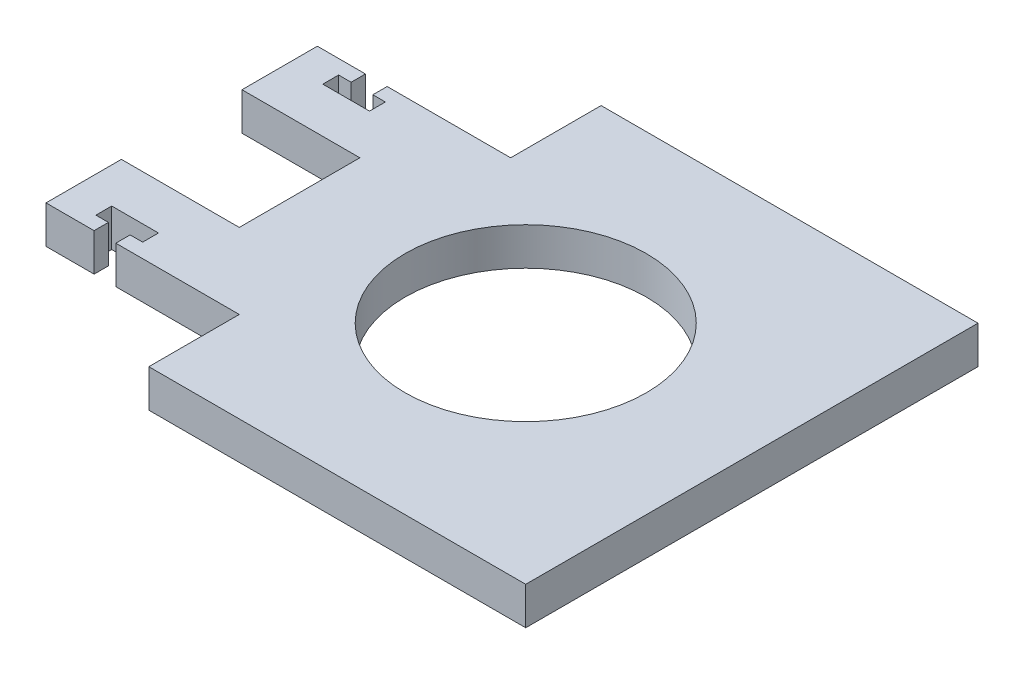
ISO-10303-21;
HEADER;
FILE_DESCRIPTION(('STEP AP214'),'2;1');
FILE_NAME('part.step','',(''),(''),'','','');
FILE_SCHEMA(('AUTOMOTIVE_DESIGN { 1 0 10303 214 1 1 1 1 }'));
ENDSEC;
DATA;
#1=APPLICATION_CONTEXT('core data for automotive mechanical design processes');
#2=APPLICATION_PROTOCOL_DEFINITION('international standard','automotive_design',2000,#1);
#3=PRODUCT_CONTEXT('',#1,'mechanical');
#4=PRODUCT('Part','Part','',(#3));
#5=PRODUCT_RELATED_PRODUCT_CATEGORY('part','',(#4));
#6=PRODUCT_DEFINITION_FORMATION('','',#4);
#7=PRODUCT_DEFINITION_CONTEXT('part definition',#1,'design');
#8=PRODUCT_DEFINITION('design','',#6,#7);
#9=PRODUCT_DEFINITION_SHAPE('','',#8);
#10=(LENGTH_UNIT() NAMED_UNIT(*) SI_UNIT(.MILLI.,.METRE.));
#11=(NAMED_UNIT(*) PLANE_ANGLE_UNIT() SI_UNIT($,.RADIAN.));
#12=(NAMED_UNIT(*) SI_UNIT($,.STERADIAN.) SOLID_ANGLE_UNIT());
#13=UNCERTAINTY_MEASURE_WITH_UNIT(LENGTH_MEASURE(1.E-05),#10,'distance_accuracy_value','');
#14=(GEOMETRIC_REPRESENTATION_CONTEXT(3) GLOBAL_UNCERTAINTY_ASSIGNED_CONTEXT((#13)) GLOBAL_UNIT_ASSIGNED_CONTEXT((#10,
#11,#12)) REPRESENTATION_CONTEXT('',''));
#15=CARTESIAN_POINT('',(0.,0.,0.));
#16=DIRECTION('',(0.,0.,1.));
#17=DIRECTION('',(1.,0.,0.));
#18=AXIS2_PLACEMENT_3D('',#15,#16,#17);
#19=CARTESIAN_POINT('',(38.1000000000002,-6.35,38.1000000000002));
#20=DIRECTION('',(1.,0.,0.));
#21=DIRECTION('',(0.,0.,-1.));
#22=AXIS2_PLACEMENT_3D('',#19,#20,#21);
#23=PLANE('',#22);
#24=DIRECTION('',(0.,0.,-1.));
#25=VECTOR('',#24,1.);
#26=CARTESIAN_POINT('',(38.1000000000002,0.,38.1000000000002));
#27=LINE('',#26,#25);
#28=CARTESIAN_POINT('',(38.1000000000002,0.,38.1000000000002));
#29=VERTEX_POINT('',#28);
#30=CARTESIAN_POINT('',(38.1000000000002,0.,-38.1000000000002));
#31=VERTEX_POINT('',#30);
#32=EDGE_CURVE('E248',#29,#31,#27,.T.);
#33=ORIENTED_EDGE('',*,*,#32,.F.);
#34=DIRECTION('',(0.,1.,0.));
#35=VECTOR('',#34,1.);
#36=CARTESIAN_POINT('',(38.1000000000002,-6.35,38.1000000000002));
#37=LINE('',#36,#35);
#38=CARTESIAN_POINT('',(38.1000000000002,-6.35,38.1000000000002));
#39=VERTEX_POINT('',#38);
#40=EDGE_CURVE('E11',#39,#29,#37,.T.);
#41=ORIENTED_EDGE('',*,*,#40,.F.);
#42=DIRECTION('',(0.,0.,-1.));
#43=VECTOR('',#42,1.);
#44=CARTESIAN_POINT('',(38.1000000000002,-6.35,38.1000000000002));
#45=LINE('',#44,#43);
#46=CARTESIAN_POINT('',(38.1000000000002,-6.35,-38.1000000000002));
#47=VERTEX_POINT('',#46);
#48=EDGE_CURVE('E329',#39,#47,#45,.T.);
#49=ORIENTED_EDGE('',*,*,#48,.T.);
#50=DIRECTION('',(0.,1.,0.));
#51=VECTOR('',#50,1.);
#52=CARTESIAN_POINT('',(38.1000000000002,-6.35,-38.1000000000002));
#53=LINE('',#52,#51);
#54=EDGE_CURVE('E36',#47,#31,#53,.T.);
#55=ORIENTED_EDGE('',*,*,#54,.T.);
#56=EDGE_LOOP('',(#33,#41,#49,#55));
#57=FACE_BOUND('',#56,.T.);
#58=ADVANCED_FACE('F33',(#57),#23,.T.);
#59=CARTESIAN_POINT('',(-25.3999999999998,-6.35,38.1000000000002));
#60=DIRECTION('',(0.,0.,1.));
#61=DIRECTION('',(1.,0.,0.));
#62=AXIS2_PLACEMENT_3D('',#59,#60,#61);
#63=PLANE('',#62);
#64=DIRECTION('',(1.,0.,0.));
#65=VECTOR('',#64,1.);
#66=CARTESIAN_POINT('',(-25.3999999999998,0.,38.1000000000002));
#67=LINE('',#66,#65);
#68=CARTESIAN_POINT('',(-25.3999999999998,0.,38.1000000000002));
#69=VERTEX_POINT('',#68);
#70=EDGE_CURVE('E327',#69,#29,#67,.T.);
#71=ORIENTED_EDGE('',*,*,#70,.F.);
#72=DIRECTION('',(0.,1.,0.));
#73=VECTOR('',#72,1.);
#74=CARTESIAN_POINT('',(-25.3999999999998,-6.35,38.1000000000002));
#75=LINE('',#74,#73);
#76=CARTESIAN_POINT('',(-25.3999999999998,-6.35,38.1000000000002));
#77=VERTEX_POINT('',#76);
#78=EDGE_CURVE('E42',#77,#69,#75,.T.);
#79=ORIENTED_EDGE('',*,*,#78,.F.);
#80=DIRECTION('',(1.,0.,0.));
#81=VECTOR('',#80,1.);
#82=CARTESIAN_POINT('',(-25.3999999999998,-6.35,38.1000000000002));
#83=LINE('',#82,#81);
#84=EDGE_CURVE('E243',#77,#39,#83,.T.);
#85=ORIENTED_EDGE('',*,*,#84,.T.);
#86=ORIENTED_EDGE('',*,*,#40,.T.);
#87=EDGE_LOOP('',(#71,#79,#85,#86));
#88=FACE_BOUND('',#87,.T.);
#89=ADVANCED_FACE('F382',(#88),#63,.T.);
#90=CARTESIAN_POINT('',(-25.3999999999998,-6.35,22.8600000000002));
#91=DIRECTION('',(-1.,0.,0.));
#92=DIRECTION('',(0.,0.,1.));
#93=AXIS2_PLACEMENT_3D('',#90,#91,#92);
#94=PLANE('',#93);
#95=DIRECTION('',(0.,0.,1.));
#96=VECTOR('',#95,1.);
#97=CARTESIAN_POINT('',(-25.3999999999998,0.,22.8600000000002));
#98=LINE('',#97,#96);
#99=CARTESIAN_POINT('',(-25.3999999999998,0.,22.8600000000002));
#100=VERTEX_POINT('',#99);
#101=EDGE_CURVE('E239',#100,#69,#98,.T.);
#102=ORIENTED_EDGE('',*,*,#101,.F.);
#103=DIRECTION('',(0.,1.,0.));
#104=VECTOR('',#103,1.);
#105=CARTESIAN_POINT('',(-25.3999999999998,-6.35,22.8600000000002));
#106=LINE('',#105,#104);
#107=CARTESIAN_POINT('',(-25.3999999999998,-6.35,22.8600000000002));
#108=VERTEX_POINT('',#107);
#109=EDGE_CURVE('E227',#108,#100,#106,.T.);
#110=ORIENTED_EDGE('',*,*,#109,.F.);
#111=DIRECTION('',(0.,0.,1.));
#112=VECTOR('',#111,1.);
#113=CARTESIAN_POINT('',(-25.3999999999998,-6.35,22.8600000000002));
#114=LINE('',#113,#112);
#115=EDGE_CURVE('E234',#108,#77,#114,.T.);
#116=ORIENTED_EDGE('',*,*,#115,.T.);
#117=ORIENTED_EDGE('',*,*,#78,.T.);
#118=EDGE_LOOP('',(#102,#110,#116,#117));
#119=FACE_BOUND('',#118,.T.);
#120=ADVANCED_FACE('F237',(#119),#94,.T.);
#121=CARTESIAN_POINT('',(-38.0999999999998,-6.35,22.8600000000002));
#122=DIRECTION('',(0.,0.,1.));
#123=DIRECTION('',(1.,0.,0.));
#124=AXIS2_PLACEMENT_3D('',#121,#122,#123);
#125=PLANE('',#124);
#126=DIRECTION('',(1.,0.,0.));
#127=VECTOR('',#126,1.);
#128=CARTESIAN_POINT('',(-38.0999999999998,0.,22.8600000000002));
#129=LINE('',#128,#127);
#130=CARTESIAN_POINT('',(-46.2025999999998,0.,22.8600000000002));
#131=VERTEX_POINT('',#130);
#132=EDGE_CURVE('E324',#131,#100,#129,.T.);
#133=ORIENTED_EDGE('',*,*,#132,.F.);
#134=DIRECTION('',(0.,1.,0.));
#135=VECTOR('',#134,1.);
#136=CARTESIAN_POINT('',(-46.2025999999998,-6.35,22.8600000000002));
#137=LINE('',#136,#135);
#138=CARTESIAN_POINT('',(-46.2025999999998,-6.35,22.8600000000002));
#139=VERTEX_POINT('',#138);
#140=EDGE_CURVE('E229',#139,#131,#137,.T.);
#141=ORIENTED_EDGE('',*,*,#140,.F.);
#142=DIRECTION('',(1.,0.,0.));
#143=VECTOR('',#142,1.);
#144=CARTESIAN_POINT('',(-38.0999999999998,-6.35,22.8600000000002));
#145=LINE('',#144,#143);
#146=EDGE_CURVE('E224',#139,#108,#145,.T.);
#147=ORIENTED_EDGE('',*,*,#146,.T.);
#148=ORIENTED_EDGE('',*,*,#109,.T.);
#149=EDGE_LOOP('',(#133,#141,#147,#148));
#150=FACE_BOUND('',#149,.T.);
#151=ADVANCED_FACE('F226',(#150),#125,.T.);
#152=CARTESIAN_POINT('',(-46.2025999999998,-6.35,22.8600000000002));
#153=DIRECTION('',(-1.,0.,0.));
#154=DIRECTION('',(0.,0.,1.));
#155=AXIS2_PLACEMENT_3D('',#152,#153,#154);
#156=PLANE('',#155);
#157=DIRECTION('',(0.,0.,1.));
#158=VECTOR('',#157,1.);
#159=CARTESIAN_POINT('',(-46.2025999999998,0.,22.8600000000002));
#160=LINE('',#159,#158);
#161=CARTESIAN_POINT('',(-46.2025999999998,0.,20.4470000000002));
#162=VERTEX_POINT('',#161);
#163=EDGE_CURVE('E321',#162,#131,#160,.T.);
#164=ORIENTED_EDGE('',*,*,#163,.F.);
#165=DIRECTION('',(0.,1.,0.));
#166=VECTOR('',#165,1.);
#167=CARTESIAN_POINT('',(-46.2025999999998,-6.35,20.4470000000002));
#168=LINE('',#167,#166);
#169=CARTESIAN_POINT('',(-46.2025999999998,-6.35,20.4470000000002));
#170=VERTEX_POINT('',#169);
#171=EDGE_CURVE('E333',#170,#162,#168,.T.);
#172=ORIENTED_EDGE('',*,*,#171,.F.);
#173=DIRECTION('',(0.,0.,1.));
#174=VECTOR('',#173,1.);
#175=CARTESIAN_POINT('',(-46.2025999999998,-6.35,22.8600000000002));
#176=LINE('',#175,#174);
#177=EDGE_CURVE('E235',#170,#139,#176,.T.);
#178=ORIENTED_EDGE('',*,*,#177,.T.);
#179=ORIENTED_EDGE('',*,*,#140,.T.);
#180=EDGE_LOOP('',(#164,#172,#178,#179));
#181=FACE_BOUND('',#180,.T.);
#182=ADVANCED_FACE('F395',(#181),#156,.T.);
#183=CARTESIAN_POINT('',(-46.2025999999998,-6.35,20.4470000000002));
#184=DIRECTION('',(0.,0.,-1.));
#185=DIRECTION('',(-1.,0.,0.));
#186=AXIS2_PLACEMENT_3D('',#183,#184,#185);
#187=PLANE('',#186);
#188=DIRECTION('',(-1.,0.,0.));
#189=VECTOR('',#188,1.);
#190=CARTESIAN_POINT('',(-46.2025999999998,0.,20.4470000000002));
#191=LINE('',#190,#189);
#192=CARTESIAN_POINT('',(-44.0943999999998,0.,20.4470000000002));
#193=VERTEX_POINT('',#192);
#194=EDGE_CURVE('E318',#193,#162,#191,.T.);
#195=ORIENTED_EDGE('',*,*,#194,.F.);
#196=DIRECTION('',(0.,1.,0.));
#197=VECTOR('',#196,1.);
#198=CARTESIAN_POINT('',(-44.0943999999998,-6.35,20.4470000000002));
#199=LINE('',#198,#197);
#200=CARTESIAN_POINT('',(-44.0943999999998,-6.35,20.4470000000002));
#201=VERTEX_POINT('',#200);
#202=EDGE_CURVE('E335',#201,#193,#199,.T.);
#203=ORIENTED_EDGE('',*,*,#202,.F.);
#204=DIRECTION('',(-1.,0.,0.));
#205=VECTOR('',#204,1.);
#206=CARTESIAN_POINT('',(-46.2025999999998,-6.35,20.4470000000002));
#207=LINE('',#206,#205);
#208=EDGE_CURVE('E575',#201,#170,#207,.T.);
#209=ORIENTED_EDGE('',*,*,#208,.T.);
#210=ORIENTED_EDGE('',*,*,#171,.T.);
#211=EDGE_LOOP('',(#195,#203,#209,#210));
#212=FACE_BOUND('',#211,.T.);
#213=ADVANCED_FACE('F398',(#212),#187,.T.);
#214=CARTESIAN_POINT('',(-44.0943999999998,-6.35,20.4470000000002));
#215=DIRECTION('',(-1.,0.,0.));
#216=DIRECTION('',(0.,0.,1.));
#217=AXIS2_PLACEMENT_3D('',#214,#215,#216);
#218=PLANE('',#217);
#219=DIRECTION('',(0.,0.,1.));
#220=VECTOR('',#219,1.);
#221=CARTESIAN_POINT('',(-44.0943999999998,0.,20.4470000000002));
#222=LINE('',#221,#220);
#223=CARTESIAN_POINT('',(-44.0943999999998,0.,17.7800000000002));
#224=VERTEX_POINT('',#223);
#225=EDGE_CURVE('E315',#224,#193,#222,.T.);
#226=ORIENTED_EDGE('',*,*,#225,.F.);
#227=DIRECTION('',(0.,1.,0.));
#228=VECTOR('',#227,1.);
#229=CARTESIAN_POINT('',(-44.0943999999998,-6.35,17.7800000000002));
#230=LINE('',#229,#228);
#231=CARTESIAN_POINT('',(-44.0943999999998,-6.35,17.7800000000002));
#232=VERTEX_POINT('',#231);
#233=EDGE_CURVE('E337',#232,#224,#230,.T.);
#234=ORIENTED_EDGE('',*,*,#233,.F.);
#235=DIRECTION('',(0.,0.,1.));
#236=VECTOR('',#235,1.);
#237=CARTESIAN_POINT('',(-44.0943999999998,-6.35,20.4470000000002));
#238=LINE('',#237,#236);
#239=EDGE_CURVE('E572',#232,#201,#238,.T.);
#240=ORIENTED_EDGE('',*,*,#239,.T.);
#241=ORIENTED_EDGE('',*,*,#202,.T.);
#242=EDGE_LOOP('',(#226,#234,#240,#241));
#243=FACE_BOUND('',#242,.T.);
#244=ADVANCED_FACE('F402',(#243),#218,.T.);
#245=CARTESIAN_POINT('',(-44.0943999999998,-6.35,17.7800000000002));
#246=DIRECTION('',(0.,0.,1.));
#247=DIRECTION('',(1.,0.,0.));
#248=AXIS2_PLACEMENT_3D('',#245,#246,#247);
#249=PLANE('',#248);
#250=DIRECTION('',(1.,0.,0.));
#251=VECTOR('',#250,1.);
#252=CARTESIAN_POINT('',(-44.0943999999998,0.,17.7800000000002));
#253=LINE('',#252,#251);
#254=CARTESIAN_POINT('',(-51.9683999999998,0.,17.7800000000002));
#255=VERTEX_POINT('',#254);
#256=EDGE_CURVE('E312',#255,#224,#253,.T.);
#257=ORIENTED_EDGE('',*,*,#256,.F.);
#258=DIRECTION('',(0.,1.,0.));
#259=VECTOR('',#258,1.);
#260=CARTESIAN_POINT('',(-51.9683999999998,-6.35,17.7800000000002));
#261=LINE('',#260,#259);
#262=CARTESIAN_POINT('',(-51.9683999999998,-6.35,17.7800000000002));
#263=VERTEX_POINT('',#262);
#264=EDGE_CURVE('E339',#263,#255,#261,.T.);
#265=ORIENTED_EDGE('',*,*,#264,.F.);
#266=DIRECTION('',(1.,0.,0.));
#267=VECTOR('',#266,1.);
#268=CARTESIAN_POINT('',(-44.0943999999998,-6.35,17.7800000000002));
#269=LINE('',#268,#267);
#270=EDGE_CURVE('E569',#263,#232,#269,.T.);
#271=ORIENTED_EDGE('',*,*,#270,.T.);
#272=ORIENTED_EDGE('',*,*,#233,.T.);
#273=EDGE_LOOP('',(#257,#265,#271,#272));
#274=FACE_BOUND('',#273,.T.);
#275=ADVANCED_FACE('F406',(#274),#249,.T.);
#276=CARTESIAN_POINT('',(-51.9683999999998,-6.35,20.4470000000002));
#277=DIRECTION('',(1.,0.,0.));
#278=DIRECTION('',(0.,0.,-1.));
#279=AXIS2_PLACEMENT_3D('',#276,#277,#278);
#280=PLANE('',#279);
#281=DIRECTION('',(0.,0.,-1.));
#282=VECTOR('',#281,1.);
#283=CARTESIAN_POINT('',(-51.9683999999998,0.,20.4470000000002));
#284=LINE('',#283,#282);
#285=CARTESIAN_POINT('',(-51.9683999999998,0.,20.4470000000002));
#286=VERTEX_POINT('',#285);
#287=EDGE_CURVE('E309',#286,#255,#284,.T.);
#288=ORIENTED_EDGE('',*,*,#287,.F.);
#289=DIRECTION('',(0.,1.,0.));
#290=VECTOR('',#289,1.);
#291=CARTESIAN_POINT('',(-51.9683999999998,-6.35,20.4470000000002));
#292=LINE('',#291,#290);
#293=CARTESIAN_POINT('',(-51.9683999999998,-6.35,20.4470000000002));
#294=VERTEX_POINT('',#293);
#295=EDGE_CURVE('E341',#294,#286,#292,.T.);
#296=ORIENTED_EDGE('',*,*,#295,.F.);
#297=DIRECTION('',(0.,0.,-1.));
#298=VECTOR('',#297,1.);
#299=CARTESIAN_POINT('',(-51.9683999999998,-6.35,20.4470000000002));
#300=LINE('',#299,#298);
#301=EDGE_CURVE('E566',#294,#263,#300,.T.);
#302=ORIENTED_EDGE('',*,*,#301,.T.);
#303=ORIENTED_EDGE('',*,*,#264,.T.);
#304=EDGE_LOOP('',(#288,#296,#302,#303));
#305=FACE_BOUND('',#304,.T.);
#306=ADVANCED_FACE('F410',(#305),#280,.T.);
#307=CARTESIAN_POINT('',(-49.8601999999998,-6.35,20.4470000000002));
#308=DIRECTION('',(0.,0.,-1.));
#309=DIRECTION('',(-1.,0.,0.));
#310=AXIS2_PLACEMENT_3D('',#307,#308,#309);
#311=PLANE('',#310);
#312=DIRECTION('',(-1.,0.,0.));
#313=VECTOR('',#312,1.);
#314=CARTESIAN_POINT('',(-49.8601999999998,0.,20.4470000000002));
#315=LINE('',#314,#313);
#316=CARTESIAN_POINT('',(-49.8601999999998,0.,20.4470000000002));
#317=VERTEX_POINT('',#316);
#318=EDGE_CURVE('E306',#317,#286,#315,.T.);
#319=ORIENTED_EDGE('',*,*,#318,.F.);
#320=DIRECTION('',(0.,1.,0.));
#321=VECTOR('',#320,1.);
#322=CARTESIAN_POINT('',(-49.8601999999998,-6.35,20.4470000000002));
#323=LINE('',#322,#321);
#324=CARTESIAN_POINT('',(-49.8601999999998,-6.35,20.4470000000002));
#325=VERTEX_POINT('',#324);
#326=EDGE_CURVE('E343',#325,#317,#323,.T.);
#327=ORIENTED_EDGE('',*,*,#326,.F.);
#328=DIRECTION('',(-1.,0.,0.));
#329=VECTOR('',#328,1.);
#330=CARTESIAN_POINT('',(-49.8601999999998,-6.35,20.4470000000002));
#331=LINE('',#330,#329);
#332=EDGE_CURVE('E563',#325,#294,#331,.T.);
#333=ORIENTED_EDGE('',*,*,#332,.T.);
#334=ORIENTED_EDGE('',*,*,#295,.T.);
#335=EDGE_LOOP('',(#319,#327,#333,#334));
#336=FACE_BOUND('',#335,.T.);
#337=ADVANCED_FACE('F414',(#336),#311,.T.);
#338=CARTESIAN_POINT('',(-49.8601999999998,-6.35,22.8600000000002));
#339=DIRECTION('',(1.,0.,0.));
#340=DIRECTION('',(0.,0.,-1.));
#341=AXIS2_PLACEMENT_3D('',#338,#339,#340);
#342=PLANE('',#341);
#343=DIRECTION('',(0.,0.,-1.));
#344=VECTOR('',#343,1.);
#345=CARTESIAN_POINT('',(-49.8601999999998,0.,22.8600000000002));
#346=LINE('',#345,#344);
#347=CARTESIAN_POINT('',(-49.8601999999998,0.,22.8600000000002));
#348=VERTEX_POINT('',#347);
#349=EDGE_CURVE('E303',#348,#317,#346,.T.);
#350=ORIENTED_EDGE('',*,*,#349,.F.);
#351=DIRECTION('',(0.,1.,0.));
#352=VECTOR('',#351,1.);
#353=CARTESIAN_POINT('',(-49.8601999999998,-6.35,22.8600000000002));
#354=LINE('',#353,#352);
#355=CARTESIAN_POINT('',(-49.8601999999998,-6.35,22.8600000000002));
#356=VERTEX_POINT('',#355);
#357=EDGE_CURVE('E345',#356,#348,#354,.T.);
#358=ORIENTED_EDGE('',*,*,#357,.F.);
#359=DIRECTION('',(0.,0.,-1.));
#360=VECTOR('',#359,1.);
#361=CARTESIAN_POINT('',(-49.8601999999998,-6.35,22.8600000000002));
#362=LINE('',#361,#360);
#363=EDGE_CURVE('E560',#356,#325,#362,.T.);
#364=ORIENTED_EDGE('',*,*,#363,.T.);
#365=ORIENTED_EDGE('',*,*,#326,.T.);
#366=EDGE_LOOP('',(#350,#358,#364,#365));
#367=FACE_BOUND('',#366,.T.);
#368=ADVANCED_FACE('F418',(#367),#342,.T.);
#369=CARTESIAN_POINT('',(-49.8601999999998,-6.35,22.8600000000002));
#370=DIRECTION('',(0.,0.,1.));
#371=DIRECTION('',(1.,0.,0.));
#372=AXIS2_PLACEMENT_3D('',#369,#370,#371);
#373=PLANE('',#372);
#374=DIRECTION('',(1.,0.,0.));
#375=VECTOR('',#374,1.);
#376=CARTESIAN_POINT('',(-49.8601999999998,0.,22.8600000000002));
#377=LINE('',#376,#375);
#378=CARTESIAN_POINT('',(-57.9627999999998,0.,22.8600000000002));
#379=VERTEX_POINT('',#378);
#380=EDGE_CURVE('E300',#379,#348,#377,.T.);
#381=ORIENTED_EDGE('',*,*,#380,.F.);
#382=DIRECTION('',(0.,1.,0.));
#383=VECTOR('',#382,1.);
#384=CARTESIAN_POINT('',(-57.9627999999998,-6.35,22.8600000000002));
#385=LINE('',#384,#383);
#386=CARTESIAN_POINT('',(-57.9627999999998,-6.35,22.8600000000002));
#387=VERTEX_POINT('',#386);
#388=EDGE_CURVE('E347',#387,#379,#385,.T.);
#389=ORIENTED_EDGE('',*,*,#388,.F.);
#390=DIRECTION('',(1.,0.,0.));
#391=VECTOR('',#390,1.);
#392=CARTESIAN_POINT('',(-49.8601999999998,-6.35,22.8600000000002));
#393=LINE('',#392,#391);
#394=EDGE_CURVE('E557',#387,#356,#393,.T.);
#395=ORIENTED_EDGE('',*,*,#394,.T.);
#396=ORIENTED_EDGE('',*,*,#357,.T.);
#397=EDGE_LOOP('',(#381,#389,#395,#396));
#398=FACE_BOUND('',#397,.T.);
#399=ADVANCED_FACE('F422',(#398),#373,.T.);
#400=CARTESIAN_POINT('',(-57.9627999999998,-6.35,22.8600000000002));
#401=DIRECTION('',(-1.,0.,0.));
#402=DIRECTION('',(0.,0.,1.));
#403=AXIS2_PLACEMENT_3D('',#400,#401,#402);
#404=PLANE('',#403);
#405=DIRECTION('',(0.,0.,1.));
#406=VECTOR('',#405,1.);
#407=CARTESIAN_POINT('',(-57.9627999999998,0.,22.8600000000002));
#408=LINE('',#407,#406);
#409=CARTESIAN_POINT('',(-57.9627999999998,0.,10.16));
#410=VERTEX_POINT('',#409);
#411=EDGE_CURVE('E297',#410,#379,#408,.T.);
#412=ORIENTED_EDGE('',*,*,#411,.F.);
#413=DIRECTION('',(0.,1.,0.));
#414=VECTOR('',#413,1.);
#415=CARTESIAN_POINT('',(-57.9627999999998,-6.35,10.16));
#416=LINE('',#415,#414);
#417=CARTESIAN_POINT('',(-57.9627999999998,-6.35,10.16));
#418=VERTEX_POINT('',#417);
#419=EDGE_CURVE('E349',#418,#410,#416,.T.);
#420=ORIENTED_EDGE('',*,*,#419,.F.);
#421=DIRECTION('',(0.,0.,1.));
#422=VECTOR('',#421,1.);
#423=CARTESIAN_POINT('',(-57.9627999999998,-6.35,22.8600000000002));
#424=LINE('',#423,#422);
#425=EDGE_CURVE('E554',#418,#387,#424,.T.);
#426=ORIENTED_EDGE('',*,*,#425,.T.);
#427=ORIENTED_EDGE('',*,*,#388,.T.);
#428=EDGE_LOOP('',(#412,#420,#426,#427));
#429=FACE_BOUND('',#428,.T.);
#430=ADVANCED_FACE('F426',(#429),#404,.T.);
#431=CARTESIAN_POINT('',(-57.9627999999998,-6.35,10.16));
#432=DIRECTION('',(0.,0.,-1.));
#433=DIRECTION('',(-1.,0.,0.));
#434=AXIS2_PLACEMENT_3D('',#431,#432,#433);
#435=PLANE('',#434);
#436=DIRECTION('',(-1.,0.,0.));
#437=VECTOR('',#436,1.);
#438=CARTESIAN_POINT('',(-57.9627999999998,0.,10.16));
#439=LINE('',#438,#437);
#440=CARTESIAN_POINT('',(-38.0999999999998,0.,10.16));
#441=VERTEX_POINT('',#440);
#442=EDGE_CURVE('E294',#441,#410,#439,.T.);
#443=ORIENTED_EDGE('',*,*,#442,.F.);
#444=DIRECTION('',(0.,1.,0.));
#445=VECTOR('',#444,1.);
#446=CARTESIAN_POINT('',(-38.0999999999998,-6.35,10.16));
#447=LINE('',#446,#445);
#448=CARTESIAN_POINT('',(-38.0999999999998,-6.35,10.16));
#449=VERTEX_POINT('',#448);
#450=EDGE_CURVE('E351',#449,#441,#447,.T.);
#451=ORIENTED_EDGE('',*,*,#450,.F.);
#452=DIRECTION('',(-1.,0.,0.));
#453=VECTOR('',#452,1.);
#454=CARTESIAN_POINT('',(-57.9627999999998,-6.35,10.16));
#455=LINE('',#454,#453);
#456=EDGE_CURVE('E551',#449,#418,#455,.T.);
#457=ORIENTED_EDGE('',*,*,#456,.T.);
#458=ORIENTED_EDGE('',*,*,#419,.T.);
#459=EDGE_LOOP('',(#443,#451,#457,#458));
#460=FACE_BOUND('',#459,.T.);
#461=ADVANCED_FACE('F430',(#460),#435,.T.);
#462=CARTESIAN_POINT('',(-38.0999999999998,-6.35,10.16));
#463=DIRECTION('',(-1.,0.,0.));
#464=DIRECTION('',(0.,0.,1.));
#465=AXIS2_PLACEMENT_3D('',#462,#463,#464);
#466=PLANE('',#465);
#467=DIRECTION('',(0.,0.,1.));
#468=VECTOR('',#467,1.);
#469=CARTESIAN_POINT('',(-38.0999999999998,0.,10.16));
#470=LINE('',#469,#468);
#471=CARTESIAN_POINT('',(-38.0999999999998,0.,-10.16));
#472=VERTEX_POINT('',#471);
#473=EDGE_CURVE('E291',#472,#441,#470,.T.);
#474=ORIENTED_EDGE('',*,*,#473,.F.);
#475=DIRECTION('',(0.,1.,0.));
#476=VECTOR('',#475,1.);
#477=CARTESIAN_POINT('',(-38.0999999999998,-6.35,-10.16));
#478=LINE('',#477,#476);
#479=CARTESIAN_POINT('',(-38.0999999999998,-6.35,-10.16));
#480=VERTEX_POINT('',#479);
#481=EDGE_CURVE('E353',#480,#472,#478,.T.);
#482=ORIENTED_EDGE('',*,*,#481,.F.);
#483=DIRECTION('',(0.,0.,1.));
#484=VECTOR('',#483,1.);
#485=CARTESIAN_POINT('',(-38.0999999999998,-6.35,10.16));
#486=LINE('',#485,#484);
#487=EDGE_CURVE('E548',#480,#449,#486,.T.);
#488=ORIENTED_EDGE('',*,*,#487,.T.);
#489=ORIENTED_EDGE('',*,*,#450,.T.);
#490=EDGE_LOOP('',(#474,#482,#488,#489));
#491=FACE_BOUND('',#490,.T.);
#492=ADVANCED_FACE('F434',(#491),#466,.T.);
#493=CARTESIAN_POINT('',(-57.9627999999998,-6.35,-10.16));
#494=DIRECTION('',(0.,0.,1.));
#495=DIRECTION('',(1.,0.,0.));
#496=AXIS2_PLACEMENT_3D('',#493,#494,#495);
#497=PLANE('',#496);
#498=DIRECTION('',(1.,0.,0.));
#499=VECTOR('',#498,1.);
#500=CARTESIAN_POINT('',(-57.9627999999998,0.,-10.16));
#501=LINE('',#500,#499);
#502=CARTESIAN_POINT('',(-57.9627999999998,0.,-10.16));
#503=VERTEX_POINT('',#502);
#504=EDGE_CURVE('E288',#503,#472,#501,.T.);
#505=ORIENTED_EDGE('',*,*,#504,.F.);
#506=DIRECTION('',(0.,1.,0.));
#507=VECTOR('',#506,1.);
#508=CARTESIAN_POINT('',(-57.9627999999998,-6.35,-10.16));
#509=LINE('',#508,#507);
#510=CARTESIAN_POINT('',(-57.9627999999998,-6.35,-10.16));
#511=VERTEX_POINT('',#510);
#512=EDGE_CURVE('E355',#511,#503,#509,.T.);
#513=ORIENTED_EDGE('',*,*,#512,.F.);
#514=DIRECTION('',(1.,0.,0.));
#515=VECTOR('',#514,1.);
#516=CARTESIAN_POINT('',(-57.9627999999998,-6.35,-10.16));
#517=LINE('',#516,#515);
#518=EDGE_CURVE('E545',#511,#480,#517,.T.);
#519=ORIENTED_EDGE('',*,*,#518,.T.);
#520=ORIENTED_EDGE('',*,*,#481,.T.);
#521=EDGE_LOOP('',(#505,#513,#519,#520));
#522=FACE_BOUND('',#521,.T.);
#523=ADVANCED_FACE('F438',(#522),#497,.T.);
#524=CARTESIAN_POINT('',(-57.9627999999998,-6.35,-22.8600000000002));
#525=DIRECTION('',(-1.,0.,0.));
#526=DIRECTION('',(0.,0.,1.));
#527=AXIS2_PLACEMENT_3D('',#524,#525,#526);
#528=PLANE('',#527);
#529=DIRECTION('',(0.,0.,1.));
#530=VECTOR('',#529,1.);
#531=CARTESIAN_POINT('',(-57.9627999999998,0.,-22.8600000000002));
#532=LINE('',#531,#530);
#533=CARTESIAN_POINT('',(-57.9627999999998,0.,-22.8600000000002));
#534=VERTEX_POINT('',#533);
#535=EDGE_CURVE('E285',#534,#503,#532,.T.);
#536=ORIENTED_EDGE('',*,*,#535,.F.);
#537=DIRECTION('',(0.,1.,0.));
#538=VECTOR('',#537,1.);
#539=CARTESIAN_POINT('',(-57.9627999999998,-6.35,-22.8600000000002));
#540=LINE('',#539,#538);
#541=CARTESIAN_POINT('',(-57.9627999999998,-6.35,-22.8600000000002));
#542=VERTEX_POINT('',#541);
#543=EDGE_CURVE('E357',#542,#534,#540,.T.);
#544=ORIENTED_EDGE('',*,*,#543,.F.);
#545=DIRECTION('',(0.,0.,1.));
#546=VECTOR('',#545,1.);
#547=CARTESIAN_POINT('',(-57.9627999999998,-6.35,-22.8600000000002));
#548=LINE('',#547,#546);
#549=EDGE_CURVE('E542',#542,#511,#548,.T.);
#550=ORIENTED_EDGE('',*,*,#549,.T.);
#551=ORIENTED_EDGE('',*,*,#512,.T.);
#552=EDGE_LOOP('',(#536,#544,#550,#551));
#553=FACE_BOUND('',#552,.T.);
#554=ADVANCED_FACE('F442',(#553),#528,.T.);
#555=CARTESIAN_POINT('',(-49.8601999999998,-6.35,-22.8600000000002));
#556=DIRECTION('',(0.,0.,-1.));
#557=DIRECTION('',(-1.,0.,0.));
#558=AXIS2_PLACEMENT_3D('',#555,#556,#557);
#559=PLANE('',#558);
#560=DIRECTION('',(-1.,0.,0.));
#561=VECTOR('',#560,1.);
#562=CARTESIAN_POINT('',(-49.8601999999998,0.,-22.8600000000002));
#563=LINE('',#562,#561);
#564=CARTESIAN_POINT('',(-49.8601999999998,0.,-22.8600000000002));
#565=VERTEX_POINT('',#564);
#566=EDGE_CURVE('E282',#565,#534,#563,.T.);
#567=ORIENTED_EDGE('',*,*,#566,.F.);
#568=DIRECTION('',(0.,1.,0.));
#569=VECTOR('',#568,1.);
#570=CARTESIAN_POINT('',(-49.8601999999998,-6.35,-22.8600000000002));
#571=LINE('',#570,#569);
#572=CARTESIAN_POINT('',(-49.8601999999998,-6.35,-22.8600000000002));
#573=VERTEX_POINT('',#572);
#574=EDGE_CURVE('E359',#573,#565,#571,.T.);
#575=ORIENTED_EDGE('',*,*,#574,.F.);
#576=DIRECTION('',(-1.,0.,0.));
#577=VECTOR('',#576,1.);
#578=CARTESIAN_POINT('',(-49.8601999999998,-6.35,-22.8600000000002));
#579=LINE('',#578,#577);
#580=EDGE_CURVE('E539',#573,#542,#579,.T.);
#581=ORIENTED_EDGE('',*,*,#580,.T.);
#582=ORIENTED_EDGE('',*,*,#543,.T.);
#583=EDGE_LOOP('',(#567,#575,#581,#582));
#584=FACE_BOUND('',#583,.T.);
#585=ADVANCED_FACE('F446',(#584),#559,.T.);
#586=CARTESIAN_POINT('',(-49.8601999999998,-6.35,-22.8600000000002));
#587=DIRECTION('',(1.,0.,0.));
#588=DIRECTION('',(0.,0.,-1.));
#589=AXIS2_PLACEMENT_3D('',#586,#587,#588);
#590=PLANE('',#589);
#591=DIRECTION('',(0.,0.,-1.));
#592=VECTOR('',#591,1.);
#593=CARTESIAN_POINT('',(-49.8601999999998,0.,-22.8600000000002));
#594=LINE('',#593,#592);
#595=CARTESIAN_POINT('',(-49.8601999999998,0.,-20.4470000000002));
#596=VERTEX_POINT('',#595);
#597=EDGE_CURVE('E279',#596,#565,#594,.T.);
#598=ORIENTED_EDGE('',*,*,#597,.F.);
#599=DIRECTION('',(0.,1.,0.));
#600=VECTOR('',#599,1.);
#601=CARTESIAN_POINT('',(-49.8601999999998,-6.35,-20.4470000000002));
#602=LINE('',#601,#600);
#603=CARTESIAN_POINT('',(-49.8601999999998,-6.35,-20.4470000000002));
#604=VERTEX_POINT('',#603);
#605=EDGE_CURVE('E361',#604,#596,#602,.T.);
#606=ORIENTED_EDGE('',*,*,#605,.F.);
#607=DIRECTION('',(0.,0.,-1.));
#608=VECTOR('',#607,1.);
#609=CARTESIAN_POINT('',(-49.8601999999998,-6.35,-22.8600000000002));
#610=LINE('',#609,#608);
#611=EDGE_CURVE('E536',#604,#573,#610,.T.);
#612=ORIENTED_EDGE('',*,*,#611,.T.);
#613=ORIENTED_EDGE('',*,*,#574,.T.);
#614=EDGE_LOOP('',(#598,#606,#612,#613));
#615=FACE_BOUND('',#614,.T.);
#616=ADVANCED_FACE('F450',(#615),#590,.T.);
#617=CARTESIAN_POINT('',(-49.8601999999998,-6.35,-20.4470000000002));
#618=DIRECTION('',(0.,0.,1.));
#619=DIRECTION('',(1.,0.,0.));
#620=AXIS2_PLACEMENT_3D('',#617,#618,#619);
#621=PLANE('',#620);
#622=DIRECTION('',(1.,0.,0.));
#623=VECTOR('',#622,1.);
#624=CARTESIAN_POINT('',(-49.8601999999998,0.,-20.4470000000002));
#625=LINE('',#624,#623);
#626=CARTESIAN_POINT('',(-51.9683999999998,0.,-20.4470000000002));
#627=VERTEX_POINT('',#626);
#628=EDGE_CURVE('E276',#627,#596,#625,.T.);
#629=ORIENTED_EDGE('',*,*,#628,.F.);
#630=DIRECTION('',(0.,1.,0.));
#631=VECTOR('',#630,1.);
#632=CARTESIAN_POINT('',(-51.9683999999998,-6.35,-20.4470000000002));
#633=LINE('',#632,#631);
#634=CARTESIAN_POINT('',(-51.9683999999998,-6.35,-20.4470000000002));
#635=VERTEX_POINT('',#634);
#636=EDGE_CURVE('E363',#635,#627,#633,.T.);
#637=ORIENTED_EDGE('',*,*,#636,.F.);
#638=DIRECTION('',(1.,0.,0.));
#639=VECTOR('',#638,1.);
#640=CARTESIAN_POINT('',(-49.8601999999998,-6.35,-20.4470000000002));
#641=LINE('',#640,#639);
#642=EDGE_CURVE('E533',#635,#604,#641,.T.);
#643=ORIENTED_EDGE('',*,*,#642,.T.);
#644=ORIENTED_EDGE('',*,*,#605,.T.);
#645=EDGE_LOOP('',(#629,#637,#643,#644));
#646=FACE_BOUND('',#645,.T.);
#647=ADVANCED_FACE('F454',(#646),#621,.T.);
#648=CARTESIAN_POINT('',(-51.9683999999998,-6.35,-20.4470000000002));
#649=DIRECTION('',(1.,0.,0.));
#650=DIRECTION('',(0.,0.,-1.));
#651=AXIS2_PLACEMENT_3D('',#648,#649,#650);
#652=PLANE('',#651);
#653=DIRECTION('',(0.,0.,-1.));
#654=VECTOR('',#653,1.);
#655=CARTESIAN_POINT('',(-51.9683999999998,0.,-20.4470000000002));
#656=LINE('',#655,#654);
#657=CARTESIAN_POINT('',(-51.9683999999998,0.,-17.7800000000002));
#658=VERTEX_POINT('',#657);
#659=EDGE_CURVE('E273',#658,#627,#656,.T.);
#660=ORIENTED_EDGE('',*,*,#659,.F.);
#661=DIRECTION('',(0.,1.,0.));
#662=VECTOR('',#661,1.);
#663=CARTESIAN_POINT('',(-51.9683999999998,-6.35,-17.7800000000002));
#664=LINE('',#663,#662);
#665=CARTESIAN_POINT('',(-51.9683999999998,-6.35,-17.7800000000002));
#666=VERTEX_POINT('',#665);
#667=EDGE_CURVE('E365',#666,#658,#664,.T.);
#668=ORIENTED_EDGE('',*,*,#667,.F.);
#669=DIRECTION('',(0.,0.,-1.));
#670=VECTOR('',#669,1.);
#671=CARTESIAN_POINT('',(-51.9683999999998,-6.35,-20.4470000000002));
#672=LINE('',#671,#670);
#673=EDGE_CURVE('E530',#666,#635,#672,.T.);
#674=ORIENTED_EDGE('',*,*,#673,.T.);
#675=ORIENTED_EDGE('',*,*,#636,.T.);
#676=EDGE_LOOP('',(#660,#668,#674,#675));
#677=FACE_BOUND('',#676,.T.);
#678=ADVANCED_FACE('F458',(#677),#652,.T.);
#679=CARTESIAN_POINT('',(-44.0943999999998,-6.35,-17.7800000000002));
#680=DIRECTION('',(0.,0.,-1.));
#681=DIRECTION('',(-1.,0.,0.));
#682=AXIS2_PLACEMENT_3D('',#679,#680,#681);
#683=PLANE('',#682);
#684=DIRECTION('',(-1.,0.,0.));
#685=VECTOR('',#684,1.);
#686=CARTESIAN_POINT('',(-44.0943999999998,0.,-17.7800000000002));
#687=LINE('',#686,#685);
#688=CARTESIAN_POINT('',(-44.0943999999998,0.,-17.7800000000002));
#689=VERTEX_POINT('',#688);
#690=EDGE_CURVE('E270',#689,#658,#687,.T.);
#691=ORIENTED_EDGE('',*,*,#690,.F.);
#692=DIRECTION('',(0.,1.,0.));
#693=VECTOR('',#692,1.);
#694=CARTESIAN_POINT('',(-44.0943999999998,-6.35,-17.7800000000002));
#695=LINE('',#694,#693);
#696=CARTESIAN_POINT('',(-44.0943999999998,-6.35,-17.7800000000002));
#697=VERTEX_POINT('',#696);
#698=EDGE_CURVE('E367',#697,#689,#695,.T.);
#699=ORIENTED_EDGE('',*,*,#698,.F.);
#700=DIRECTION('',(-1.,0.,0.));
#701=VECTOR('',#700,1.);
#702=CARTESIAN_POINT('',(-44.0943999999998,-6.35,-17.7800000000002));
#703=LINE('',#702,#701);
#704=EDGE_CURVE('E527',#697,#666,#703,.T.);
#705=ORIENTED_EDGE('',*,*,#704,.T.);
#706=ORIENTED_EDGE('',*,*,#667,.T.);
#707=EDGE_LOOP('',(#691,#699,#705,#706));
#708=FACE_BOUND('',#707,.T.);
#709=ADVANCED_FACE('F462',(#708),#683,.T.);
#710=CARTESIAN_POINT('',(-44.0943999999998,-6.35,-20.4470000000002));
#711=DIRECTION('',(-1.,0.,0.));
#712=DIRECTION('',(0.,0.,1.));
#713=AXIS2_PLACEMENT_3D('',#710,#711,#712);
#714=PLANE('',#713);
#715=DIRECTION('',(0.,0.,1.));
#716=VECTOR('',#715,1.);
#717=CARTESIAN_POINT('',(-44.0943999999998,0.,-20.4470000000002));
#718=LINE('',#717,#716);
#719=CARTESIAN_POINT('',(-44.0943999999998,0.,-20.4470000000002));
#720=VERTEX_POINT('',#719);
#721=EDGE_CURVE('E267',#720,#689,#718,.T.);
#722=ORIENTED_EDGE('',*,*,#721,.F.);
#723=DIRECTION('',(0.,1.,0.));
#724=VECTOR('',#723,1.);
#725=CARTESIAN_POINT('',(-44.0943999999998,-6.35,-20.4470000000002));
#726=LINE('',#725,#724);
#727=CARTESIAN_POINT('',(-44.0943999999998,-6.35,-20.4470000000002));
#728=VERTEX_POINT('',#727);
#729=EDGE_CURVE('E369',#728,#720,#726,.T.);
#730=ORIENTED_EDGE('',*,*,#729,.F.);
#731=DIRECTION('',(0.,0.,1.));
#732=VECTOR('',#731,1.);
#733=CARTESIAN_POINT('',(-44.0943999999998,-6.35,-20.4470000000002));
#734=LINE('',#733,#732);
#735=EDGE_CURVE('E524',#728,#697,#734,.T.);
#736=ORIENTED_EDGE('',*,*,#735,.T.);
#737=ORIENTED_EDGE('',*,*,#698,.T.);
#738=EDGE_LOOP('',(#722,#730,#736,#737));
#739=FACE_BOUND('',#738,.T.);
#740=ADVANCED_FACE('F466',(#739),#714,.T.);
#741=CARTESIAN_POINT('',(-46.2025999999998,-6.35,-20.4470000000002));
#742=DIRECTION('',(0.,0.,1.));
#743=DIRECTION('',(1.,0.,0.));
#744=AXIS2_PLACEMENT_3D('',#741,#742,#743);
#745=PLANE('',#744);
#746=DIRECTION('',(1.,0.,0.));
#747=VECTOR('',#746,1.);
#748=CARTESIAN_POINT('',(-46.2025999999998,0.,-20.4470000000002));
#749=LINE('',#748,#747);
#750=CARTESIAN_POINT('',(-46.2025999999998,0.,-20.4470000000002));
#751=VERTEX_POINT('',#750);
#752=EDGE_CURVE('E264',#751,#720,#749,.T.);
#753=ORIENTED_EDGE('',*,*,#752,.F.);
#754=DIRECTION('',(0.,1.,0.));
#755=VECTOR('',#754,1.);
#756=CARTESIAN_POINT('',(-46.2025999999998,-6.35,-20.4470000000002));
#757=LINE('',#756,#755);
#758=CARTESIAN_POINT('',(-46.2025999999998,-6.35,-20.4470000000002));
#759=VERTEX_POINT('',#758);
#760=EDGE_CURVE('E371',#759,#751,#757,.T.);
#761=ORIENTED_EDGE('',*,*,#760,.F.);
#762=DIRECTION('',(1.,0.,0.));
#763=VECTOR('',#762,1.);
#764=CARTESIAN_POINT('',(-46.2025999999998,-6.35,-20.4470000000002));
#765=LINE('',#764,#763);
#766=EDGE_CURVE('E521',#759,#728,#765,.T.);
#767=ORIENTED_EDGE('',*,*,#766,.T.);
#768=ORIENTED_EDGE('',*,*,#729,.T.);
#769=EDGE_LOOP('',(#753,#761,#767,#768));
#770=FACE_BOUND('',#769,.T.);
#771=ADVANCED_FACE('F470',(#770),#745,.T.);
#772=CARTESIAN_POINT('',(-46.2025999999998,-6.35,-22.8600000000002));
#773=DIRECTION('',(-1.,0.,0.));
#774=DIRECTION('',(0.,0.,1.));
#775=AXIS2_PLACEMENT_3D('',#772,#773,#774);
#776=PLANE('',#775);
#777=DIRECTION('',(0.,0.,1.));
#778=VECTOR('',#777,1.);
#779=CARTESIAN_POINT('',(-46.2025999999998,0.,-22.8600000000002));
#780=LINE('',#779,#778);
#781=CARTESIAN_POINT('',(-46.2025999999998,0.,-22.8600000000002));
#782=VERTEX_POINT('',#781);
#783=EDGE_CURVE('E261',#782,#751,#780,.T.);
#784=ORIENTED_EDGE('',*,*,#783,.F.);
#785=DIRECTION('',(0.,1.,0.));
#786=VECTOR('',#785,1.);
#787=CARTESIAN_POINT('',(-46.2025999999998,-6.35,-22.8600000000002));
#788=LINE('',#787,#786);
#789=CARTESIAN_POINT('',(-46.2025999999998,-6.35,-22.8600000000002));
#790=VERTEX_POINT('',#789);
#791=EDGE_CURVE('E373',#790,#782,#788,.T.);
#792=ORIENTED_EDGE('',*,*,#791,.F.);
#793=DIRECTION('',(0.,0.,1.));
#794=VECTOR('',#793,1.);
#795=CARTESIAN_POINT('',(-46.2025999999998,-6.35,-22.8600000000002));
#796=LINE('',#795,#794);
#797=EDGE_CURVE('E518',#790,#759,#796,.T.);
#798=ORIENTED_EDGE('',*,*,#797,.T.);
#799=ORIENTED_EDGE('',*,*,#760,.T.);
#800=EDGE_LOOP('',(#784,#792,#798,#799));
#801=FACE_BOUND('',#800,.T.);
#802=ADVANCED_FACE('F474',(#801),#776,.T.);
#803=CARTESIAN_POINT('',(-38.0999999999998,-6.35,-22.8600000000002));
#804=DIRECTION('',(0.,0.,-1.));
#805=DIRECTION('',(-1.,0.,0.));
#806=AXIS2_PLACEMENT_3D('',#803,#804,#805);
#807=PLANE('',#806);
#808=DIRECTION('',(-1.,0.,0.));
#809=VECTOR('',#808,1.);
#810=CARTESIAN_POINT('',(-38.0999999999998,0.,-22.8600000000002));
#811=LINE('',#810,#809);
#812=CARTESIAN_POINT('',(-25.3999999999998,0.,-22.8600000000002));
#813=VERTEX_POINT('',#812);
#814=EDGE_CURVE('E258',#813,#782,#811,.T.);
#815=ORIENTED_EDGE('',*,*,#814,.F.);
#816=DIRECTION('',(0.,1.,0.));
#817=VECTOR('',#816,1.);
#818=CARTESIAN_POINT('',(-25.3999999999998,-6.35,-22.8600000000002));
#819=LINE('',#818,#817);
#820=CARTESIAN_POINT('',(-25.3999999999998,-6.35,-22.8600000000002));
#821=VERTEX_POINT('',#820);
#822=EDGE_CURVE('E375',#821,#813,#819,.T.);
#823=ORIENTED_EDGE('',*,*,#822,.F.);
#824=DIRECTION('',(-1.,0.,0.));
#825=VECTOR('',#824,1.);
#826=CARTESIAN_POINT('',(-38.0999999999998,-6.35,-22.8600000000002));
#827=LINE('',#826,#825);
#828=EDGE_CURVE('E516',#821,#790,#827,.T.);
#829=ORIENTED_EDGE('',*,*,#828,.T.);
#830=ORIENTED_EDGE('',*,*,#791,.T.);
#831=EDGE_LOOP('',(#815,#823,#829,#830));
#832=FACE_BOUND('',#831,.T.);
#833=ADVANCED_FACE('F478',(#832),#807,.T.);
#834=CARTESIAN_POINT('',(-25.3999999999998,-6.35,-22.8600000000002));
#835=DIRECTION('',(-1.,0.,0.));
#836=DIRECTION('',(0.,0.,1.));
#837=AXIS2_PLACEMENT_3D('',#834,#835,#836);
#838=PLANE('',#837);
#839=DIRECTION('',(0.,0.,1.));
#840=VECTOR('',#839,1.);
#841=CARTESIAN_POINT('',(-25.3999999999998,0.,-22.8600000000002));
#842=LINE('',#841,#840);
#843=CARTESIAN_POINT('',(-25.3999999999998,0.,-38.1000000000002));
#844=VERTEX_POINT('',#843);
#845=EDGE_CURVE('E255',#844,#813,#842,.T.);
#846=ORIENTED_EDGE('',*,*,#845,.F.);
#847=DIRECTION('',(0.,1.,0.));
#848=VECTOR('',#847,1.);
#849=CARTESIAN_POINT('',(-25.3999999999998,-6.35,-38.1000000000002));
#850=LINE('',#849,#848);
#851=CARTESIAN_POINT('',(-25.3999999999998,-6.35,-38.1000000000002));
#852=VERTEX_POINT('',#851);
#853=EDGE_CURVE('E377',#852,#844,#850,.T.);
#854=ORIENTED_EDGE('',*,*,#853,.F.);
#855=DIRECTION('',(0.,0.,1.));
#856=VECTOR('',#855,1.);
#857=CARTESIAN_POINT('',(-25.3999999999998,-6.35,-22.8600000000002));
#858=LINE('',#857,#856);
#859=EDGE_CURVE('E513',#852,#821,#858,.T.);
#860=ORIENTED_EDGE('',*,*,#859,.T.);
#861=ORIENTED_EDGE('',*,*,#822,.T.);
#862=EDGE_LOOP('',(#846,#854,#860,#861));
#863=FACE_BOUND('',#862,.T.);
#864=ADVANCED_FACE('F482',(#863),#838,.T.);
#865=CARTESIAN_POINT('',(-25.3999999999998,-6.35,-38.1000000000002));
#866=DIRECTION('',(0.,0.,-1.));
#867=DIRECTION('',(-1.,0.,0.));
#868=AXIS2_PLACEMENT_3D('',#865,#866,#867);
#869=PLANE('',#868);
#870=DIRECTION('',(-1.,0.,0.));
#871=VECTOR('',#870,1.);
#872=CARTESIAN_POINT('',(-25.3999999999998,0.,-38.1000000000002));
#873=LINE('',#872,#871);
#874=EDGE_CURVE('E251',#31,#844,#873,.T.);
#875=ORIENTED_EDGE('',*,*,#874,.F.);
#876=ORIENTED_EDGE('',*,*,#54,.F.);
#877=DIRECTION('',(-1.,0.,0.));
#878=VECTOR('',#877,1.);
#879=CARTESIAN_POINT('',(-25.3999999999998,-6.35,-38.1000000000002));
#880=LINE('',#879,#878);
#881=EDGE_CURVE('E511',#47,#852,#880,.T.);
#882=ORIENTED_EDGE('',*,*,#881,.T.);
#883=ORIENTED_EDGE('',*,*,#853,.T.);
#884=EDGE_LOOP('',(#875,#876,#882,#883));
#885=FACE_BOUND('',#884,.T.);
#886=ADVANCED_FACE('F379',(#885),#869,.T.);
#887=CARTESIAN_POINT('',(0.,-6.35,0.));
#888=DIRECTION('',(0.,-1.,0.));
#889=DIRECTION('',(0.,0.,-1.));
#890=AXIS2_PLACEMENT_3D('',#887,#888,#889);
#891=PLANE('',#890);
#892=CARTESIAN_POINT('',(0.,-6.35,0.));
#893=DIRECTION('',(0.,1.,0.));
#894=DIRECTION('',(0.,0.,1.));
#895=AXIS2_PLACEMENT_3D('',#892,#893,#894);
#896=CIRCLE('',#895,20.32);
#897=CARTESIAN_POINT('',(0.,-6.35,20.32));
#898=VERTEX_POINT('',#897);
#899=EDGE_CURVE('E252',#898,#898,#896,.T.);
#900=ORIENTED_EDGE('',*,*,#899,.T.);
#901=EDGE_LOOP('',(#900));
#902=FACE_BOUND('',#901,.T.);
#903=ORIENTED_EDGE('',*,*,#48,.F.);
#904=ORIENTED_EDGE('',*,*,#84,.F.);
#905=ORIENTED_EDGE('',*,*,#115,.F.);
#906=ORIENTED_EDGE('',*,*,#146,.F.);
#907=ORIENTED_EDGE('',*,*,#177,.F.);
#908=ORIENTED_EDGE('',*,*,#208,.F.);
#909=ORIENTED_EDGE('',*,*,#239,.F.);
#910=ORIENTED_EDGE('',*,*,#270,.F.);
#911=ORIENTED_EDGE('',*,*,#301,.F.);
#912=ORIENTED_EDGE('',*,*,#332,.F.);
#913=ORIENTED_EDGE('',*,*,#363,.F.);
#914=ORIENTED_EDGE('',*,*,#394,.F.);
#915=ORIENTED_EDGE('',*,*,#425,.F.);
#916=ORIENTED_EDGE('',*,*,#456,.F.);
#917=ORIENTED_EDGE('',*,*,#487,.F.);
#918=ORIENTED_EDGE('',*,*,#518,.F.);
#919=ORIENTED_EDGE('',*,*,#549,.F.);
#920=ORIENTED_EDGE('',*,*,#580,.F.);
#921=ORIENTED_EDGE('',*,*,#611,.F.);
#922=ORIENTED_EDGE('',*,*,#642,.F.);
#923=ORIENTED_EDGE('',*,*,#673,.F.);
#924=ORIENTED_EDGE('',*,*,#704,.F.);
#925=ORIENTED_EDGE('',*,*,#735,.F.);
#926=ORIENTED_EDGE('',*,*,#766,.F.);
#927=ORIENTED_EDGE('',*,*,#797,.F.);
#928=ORIENTED_EDGE('',*,*,#828,.F.);
#929=ORIENTED_EDGE('',*,*,#859,.F.);
#930=ORIENTED_EDGE('',*,*,#881,.F.);
#931=EDGE_LOOP('',(#903,#904,#905,#906,#907,#908,#909,#910,#911,#912,#913,#914,#915,#916,#917,
#918,#919,#920,#921,#922,#923,#924,#925,#926,#927,#928,#929,#930));
#932=FACE_BOUND('',#931,.T.);
#933=ADVANCED_FACE('F242',(#902,#932),#891,.T.);
#934=CARTESIAN_POINT('',(0.,0.,0.));
#935=DIRECTION('',(0.,-1.,0.));
#936=DIRECTION('',(0.,0.,-1.));
#937=AXIS2_PLACEMENT_3D('',#934,#935,#936);
#938=PLANE('',#937);
#939=CARTESIAN_POINT('',(0.,0.,0.));
#940=DIRECTION('',(0.,1.,0.));
#941=DIRECTION('',(0.,0.,1.));
#942=AXIS2_PLACEMENT_3D('',#939,#940,#941);
#943=CIRCLE('',#942,20.32);
#944=CARTESIAN_POINT('',(0.,0.,20.32));
#945=VERTEX_POINT('',#944);
#946=EDGE_CURVE('E506',#945,#945,#943,.T.);
#947=ORIENTED_EDGE('',*,*,#946,.F.);
#948=EDGE_LOOP('',(#947));
#949=FACE_BOUND('',#948,.T.);
#950=ORIENTED_EDGE('',*,*,#32,.T.);
#951=ORIENTED_EDGE('',*,*,#874,.T.);
#952=ORIENTED_EDGE('',*,*,#845,.T.);
#953=ORIENTED_EDGE('',*,*,#814,.T.);
#954=ORIENTED_EDGE('',*,*,#783,.T.);
#955=ORIENTED_EDGE('',*,*,#752,.T.);
#956=ORIENTED_EDGE('',*,*,#721,.T.);
#957=ORIENTED_EDGE('',*,*,#690,.T.);
#958=ORIENTED_EDGE('',*,*,#659,.T.);
#959=ORIENTED_EDGE('',*,*,#628,.T.);
#960=ORIENTED_EDGE('',*,*,#597,.T.);
#961=ORIENTED_EDGE('',*,*,#566,.T.);
#962=ORIENTED_EDGE('',*,*,#535,.T.);
#963=ORIENTED_EDGE('',*,*,#504,.T.);
#964=ORIENTED_EDGE('',*,*,#473,.T.);
#965=ORIENTED_EDGE('',*,*,#442,.T.);
#966=ORIENTED_EDGE('',*,*,#411,.T.);
#967=ORIENTED_EDGE('',*,*,#380,.T.);
#968=ORIENTED_EDGE('',*,*,#349,.T.);
#969=ORIENTED_EDGE('',*,*,#318,.T.);
#970=ORIENTED_EDGE('',*,*,#287,.T.);
#971=ORIENTED_EDGE('',*,*,#256,.T.);
#972=ORIENTED_EDGE('',*,*,#225,.T.);
#973=ORIENTED_EDGE('',*,*,#194,.T.);
#974=ORIENTED_EDGE('',*,*,#163,.T.);
#975=ORIENTED_EDGE('',*,*,#132,.T.);
#976=ORIENTED_EDGE('',*,*,#101,.T.);
#977=ORIENTED_EDGE('',*,*,#70,.T.);
#978=EDGE_LOOP('',(#950,#951,#952,#953,#954,#955,#956,#957,#958,#959,#960,#961,#962,#963,#964,
#965,#966,#967,#968,#969,#970,#971,#972,#973,#974,#975,#976,#977));
#979=FACE_BOUND('',#978,.T.);
#980=ADVANCED_FACE('F381',(#949,#979),#938,.F.);
#981=CARTESIAN_POINT('',(0.,-6.35,0.));
#982=DIRECTION('',(0.,1.,0.));
#983=DIRECTION('',(0.,0.,1.));
#984=AXIS2_PLACEMENT_3D('',#981,#982,#983);
#985=CYLINDRICAL_SURFACE('',#984,20.32);
#986=ORIENTED_EDGE('',*,*,#899,.F.);
#987=EDGE_LOOP('',(#986));
#988=FACE_BOUND('',#987,.T.);
#989=ORIENTED_EDGE('',*,*,#946,.T.);
#990=EDGE_LOOP('',(#989));
#991=FACE_BOUND('',#990,.T.);
#992=ADVANCED_FACE('F494',(#988,#991),#985,.F.);
#993=CLOSED_SHELL('',(#58,#89,#120,#151,#182,#213,#244,#275,#306,#337,#368,#399,#430,#461,#492,
#523,#554,#585,#616,#647,#678,#709,#740,#771,#802,#833,#864,#886,#933,#980,#992));
#994=MANIFOLD_SOLID_BREP('B2',#993);
#995=ADVANCED_BREP_SHAPE_REPRESENTATION('',(#18,#994),#14);
#996=SHAPE_DEFINITION_REPRESENTATION(#9,#995);
ENDSEC;
END-ISO-10303-21;
